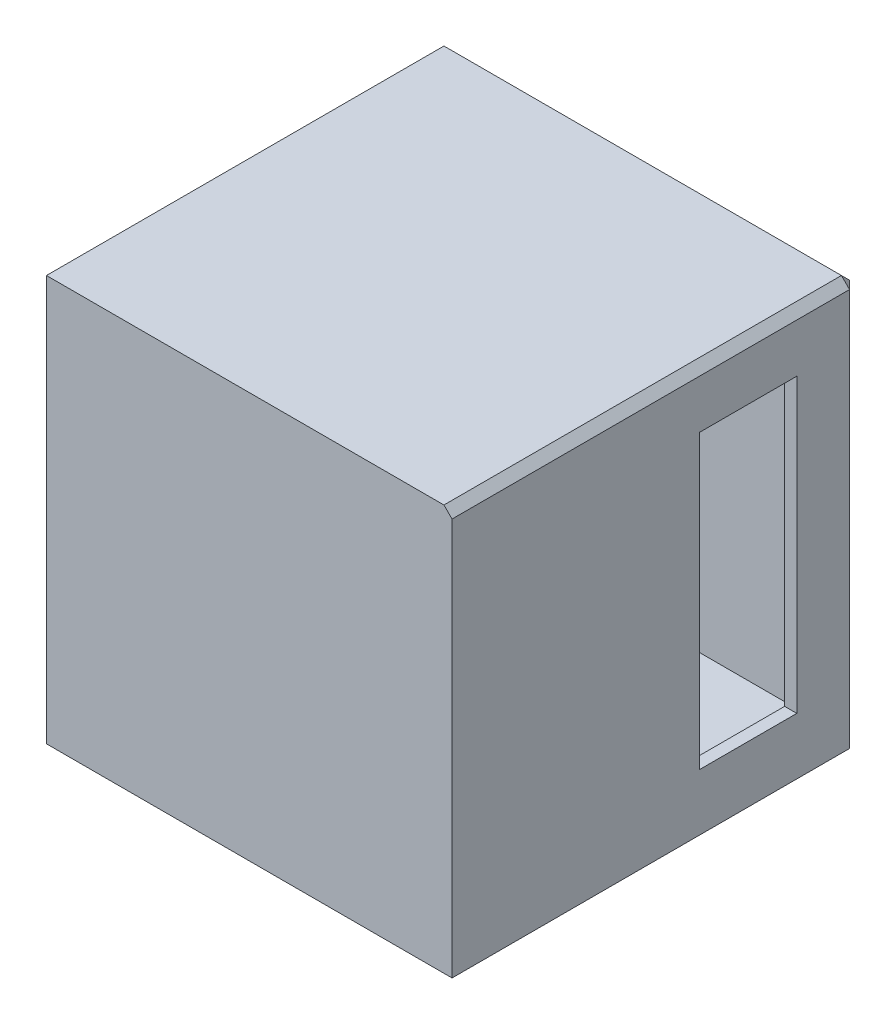
ISO-10303-21;
HEADER;
FILE_DESCRIPTION(('STEP AP214'),'2;1');
FILE_NAME('part.step','',(''),(''),'','','');
FILE_SCHEMA(('AUTOMOTIVE_DESIGN { 1 0 10303 214 1 1 1 1 }'));
ENDSEC;
DATA;
#1=APPLICATION_CONTEXT('core data for automotive mechanical design processes');
#2=APPLICATION_PROTOCOL_DEFINITION('international standard','automotive_design',2000,#1);
#3=PRODUCT_CONTEXT('',#1,'mechanical');
#4=PRODUCT('Part','Part','',(#3));
#5=PRODUCT_RELATED_PRODUCT_CATEGORY('part','',(#4));
#6=PRODUCT_DEFINITION_FORMATION('','',#4);
#7=PRODUCT_DEFINITION_CONTEXT('part definition',#1,'design');
#8=PRODUCT_DEFINITION('design','',#6,#7);
#9=PRODUCT_DEFINITION_SHAPE('','',#8);
#10=(LENGTH_UNIT() NAMED_UNIT(*) SI_UNIT(.MILLI.,.METRE.));
#11=(NAMED_UNIT(*) PLANE_ANGLE_UNIT() SI_UNIT($,.RADIAN.));
#12=(NAMED_UNIT(*) SI_UNIT($,.STERADIAN.) SOLID_ANGLE_UNIT());
#13=UNCERTAINTY_MEASURE_WITH_UNIT(LENGTH_MEASURE(1.E-05),#10,'distance_accuracy_value','');
#14=(GEOMETRIC_REPRESENTATION_CONTEXT(3) GLOBAL_UNCERTAINTY_ASSIGNED_CONTEXT((#13)) GLOBAL_UNIT_ASSIGNED_CONTEXT((#10,
#11,#12)) REPRESENTATION_CONTEXT('',''));
#15=CARTESIAN_POINT('',(0.,0.,0.));
#16=DIRECTION('',(0.,0.,1.));
#17=DIRECTION('',(1.,0.,0.));
#18=AXIS2_PLACEMENT_3D('',#15,#16,#17);
#19=CARTESIAN_POINT('',(0.,100.,3.));
#20=DIRECTION('',(1.,0.,0.));
#21=DIRECTION('',(0.,1.,0.));
#22=AXIS2_PLACEMENT_3D('',#19,#20,#21);
#23=PLANE('',#22);
#24=DIRECTION('',(0.,0.,-1.));
#25=VECTOR('',#24,1.);
#26=CARTESIAN_POINT('',(0.,100.,3.));
#27=LINE('',#26,#25);
#28=CARTESIAN_POINT('',(0.,100.,100.));
#29=VERTEX_POINT('',#28);
#30=CARTESIAN_POINT('',(0.,100.,2.));
#31=VERTEX_POINT('',#30);
#32=EDGE_CURVE('E230',#29,#31,#27,.T.);
#33=ORIENTED_EDGE('',*,*,#32,.T.);
#34=DIRECTION('',(0.,0.70710678118655,0.707106781186545));
#35=VECTOR('',#34,1.);
#36=CARTESIAN_POINT('',(0.,100.,2.));
#37=LINE('',#36,#35);
#38=CARTESIAN_POINT('',(0.,98.,0.));
#39=VERTEX_POINT('',#38);
#40=EDGE_CURVE('E11',#31,#39,#37,.F.);
#41=ORIENTED_EDGE('',*,*,#40,.T.);
#42=DIRECTION('',(0.,-1.,0.));
#43=VECTOR('',#42,1.);
#44=CARTESIAN_POINT('',(0.,100.,0.));
#45=LINE('',#44,#43);
#46=CARTESIAN_POINT('',(0.,0.,0.));
#47=VERTEX_POINT('',#46);
#48=EDGE_CURVE('E226',#39,#47,#45,.T.);
#49=ORIENTED_EDGE('',*,*,#48,.T.);
#50=DIRECTION('',(0.,0.,-1.));
#51=VECTOR('',#50,1.);
#52=CARTESIAN_POINT('',(0.,0.,3.));
#53=LINE('',#52,#51);
#54=CARTESIAN_POINT('',(0.,0.,100.));
#55=VERTEX_POINT('',#54);
#56=EDGE_CURVE('E236',#55,#47,#53,.T.);
#57=ORIENTED_EDGE('',*,*,#56,.F.);
#58=DIRECTION('',(0.,-1.,0.));
#59=VECTOR('',#58,1.);
#60=CARTESIAN_POINT('',(0.,100.,100.));
#61=LINE('',#60,#59);
#62=EDGE_CURVE('E180',#29,#55,#61,.T.);
#63=ORIENTED_EDGE('',*,*,#62,.F.);
#64=EDGE_LOOP('',(#33,#41,#49,#57,#63));
#65=FACE_BOUND('',#64,.T.);
#66=ADVANCED_FACE('F35',(#65),#23,.F.);
#67=CARTESIAN_POINT('',(0.,0.,3.));
#68=DIRECTION('',(0.,1.,0.));
#69=DIRECTION('',(0.,0.,1.));
#70=AXIS2_PLACEMENT_3D('',#67,#68,#69);
#71=PLANE('',#70);
#72=DIRECTION('',(1.,0.,0.));
#73=VECTOR('',#72,1.);
#74=CARTESIAN_POINT('',(0.,0.,0.));
#75=LINE('',#74,#73);
#76=CARTESIAN_POINT('',(97.9999999999999,0.,0.));
#77=VERTEX_POINT('',#76);
#78=EDGE_CURVE('E228',#47,#77,#75,.T.);
#79=ORIENTED_EDGE('',*,*,#78,.T.);
#80=DIRECTION('',(-0.70710678118655,0.,-0.707106781186545));
#81=VECTOR('',#80,1.);
#82=CARTESIAN_POINT('',(100.,0.,1.99999999999999));
#83=LINE('',#82,#81);
#84=CARTESIAN_POINT('',(100.,0.,2.00000000000001));
#85=VERTEX_POINT('',#84);
#86=EDGE_CURVE('E44',#77,#85,#83,.F.);
#87=ORIENTED_EDGE('',*,*,#86,.T.);
#88=DIRECTION('',(0.,0.,-1.));
#89=VECTOR('',#88,1.);
#90=CARTESIAN_POINT('',(100.,0.,3.));
#91=LINE('',#90,#89);
#92=CARTESIAN_POINT('',(100.,0.,100.));
#93=VERTEX_POINT('',#92);
#94=EDGE_CURVE('E233',#93,#85,#91,.T.);
#95=ORIENTED_EDGE('',*,*,#94,.F.);
#96=DIRECTION('',(1.,0.,0.));
#97=VECTOR('',#96,1.);
#98=CARTESIAN_POINT('',(0.,0.,100.));
#99=LINE('',#98,#97);
#100=EDGE_CURVE('E186',#55,#93,#99,.T.);
#101=ORIENTED_EDGE('',*,*,#100,.F.);
#102=ORIENTED_EDGE('',*,*,#56,.T.);
#103=EDGE_LOOP('',(#79,#87,#95,#101,#102));
#104=FACE_BOUND('',#103,.T.);
#105=ADVANCED_FACE('F283',(#104),#71,.F.);
#106=CARTESIAN_POINT('',(100.,100.,3.));
#107=DIRECTION('',(-1.,0.,0.));
#108=DIRECTION('',(0.,-1.,0.));
#109=AXIS2_PLACEMENT_3D('',#106,#107,#108);
#110=PLANE('',#109);
#111=DIRECTION('',(0.,0.,1.));
#112=VECTOR('',#111,1.);
#113=CARTESIAN_POINT('',(100.,86.,15.));
#114=LINE('',#113,#112);
#115=CARTESIAN_POINT('',(100.,86.,15.));
#116=VERTEX_POINT('',#115);
#117=CARTESIAN_POINT('',(100.,86.,39.));
#118=VERTEX_POINT('',#117);
#119=EDGE_CURVE('E174',#116,#118,#114,.T.);
#120=ORIENTED_EDGE('',*,*,#119,.F.);
#121=DIRECTION('',(0.,1.,0.));
#122=VECTOR('',#121,1.);
#123=CARTESIAN_POINT('',(100.,86.,15.));
#124=LINE('',#123,#122);
#125=CARTESIAN_POINT('',(100.,14.,15.));
#126=VERTEX_POINT('',#125);
#127=EDGE_CURVE('E147',#126,#116,#124,.T.);
#128=ORIENTED_EDGE('',*,*,#127,.F.);
#129=DIRECTION('',(0.,0.,-1.));
#130=VECTOR('',#129,1.);
#131=CARTESIAN_POINT('',(100.,14.,15.));
#132=LINE('',#131,#130);
#133=CARTESIAN_POINT('',(100.,14.,39.));
#134=VERTEX_POINT('',#133);
#135=EDGE_CURVE('E165',#134,#126,#132,.T.);
#136=ORIENTED_EDGE('',*,*,#135,.F.);
#137=DIRECTION('',(0.,-1.,0.));
#138=VECTOR('',#137,1.);
#139=CARTESIAN_POINT('',(100.,86.,39.));
#140=LINE('',#139,#138);
#141=EDGE_CURVE('E168',#118,#134,#140,.T.);
#142=ORIENTED_EDGE('',*,*,#141,.F.);
#143=EDGE_LOOP('',(#120,#128,#136,#142));
#144=FACE_BOUND('',#143,.T.);
#145=DIRECTION('',(0.,1.,0.));
#146=VECTOR('',#145,1.);
#147=CARTESIAN_POINT('',(100.,100.,2.));
#148=LINE('',#147,#146);
#149=CARTESIAN_POINT('',(100.,98.,2.));
#150=VERTEX_POINT('',#149);
#151=EDGE_CURVE('E244',#85,#150,#148,.T.);
#152=ORIENTED_EDGE('',*,*,#151,.T.);
#153=DIRECTION('',(0.,0.,1.));
#154=VECTOR('',#153,1.);
#155=CARTESIAN_POINT('',(100.,98.,3.));
#156=LINE('',#155,#154);
#157=CARTESIAN_POINT('',(100.,98.,100.));
#158=VERTEX_POINT('',#157);
#159=EDGE_CURVE('E246',#150,#158,#156,.T.);
#160=ORIENTED_EDGE('',*,*,#159,.T.);
#161=DIRECTION('',(0.,1.,0.));
#162=VECTOR('',#161,1.);
#163=CARTESIAN_POINT('',(100.,100.,100.));
#164=LINE('',#163,#162);
#165=EDGE_CURVE('E189',#93,#158,#164,.T.);
#166=ORIENTED_EDGE('',*,*,#165,.F.);
#167=ORIENTED_EDGE('',*,*,#94,.T.);
#168=EDGE_LOOP('',(#152,#160,#166,#167));
#169=FACE_BOUND('',#168,.T.);
#170=ADVANCED_FACE('F276',(#144,#169),#110,.F.);
#171=CARTESIAN_POINT('',(0.,100.,3.));
#172=DIRECTION('',(0.,-1.,0.));
#173=DIRECTION('',(0.,0.,-1.));
#174=AXIS2_PLACEMENT_3D('',#171,#172,#173);
#175=PLANE('',#174);
#176=DIRECTION('',(-1.,0.,0.));
#177=VECTOR('',#176,1.);
#178=CARTESIAN_POINT('',(0.,100.,100.));
#179=LINE('',#178,#177);
#180=CARTESIAN_POINT('',(97.9999999999999,100.,100.));
#181=VERTEX_POINT('',#180);
#182=EDGE_CURVE('E192',#181,#29,#179,.T.);
#183=ORIENTED_EDGE('',*,*,#182,.F.);
#184=DIRECTION('',(0.,0.,-1.));
#185=VECTOR('',#184,1.);
#186=CARTESIAN_POINT('',(98.,100.,3.));
#187=LINE('',#186,#185);
#188=CARTESIAN_POINT('',(98.,100.,2.));
#189=VERTEX_POINT('',#188);
#190=EDGE_CURVE('E241',#181,#189,#187,.T.);
#191=ORIENTED_EDGE('',*,*,#190,.T.);
#192=DIRECTION('',(-1.,0.,0.));
#193=VECTOR('',#192,1.);
#194=CARTESIAN_POINT('',(0.,100.,2.));
#195=LINE('',#194,#193);
#196=EDGE_CURVE('E239',#189,#31,#195,.T.);
#197=ORIENTED_EDGE('',*,*,#196,.T.);
#198=ORIENTED_EDGE('',*,*,#32,.F.);
#199=EDGE_LOOP('',(#183,#191,#197,#198));
#200=FACE_BOUND('',#199,.T.);
#201=ADVANCED_FACE('F269',(#200),#175,.F.);
#202=CARTESIAN_POINT('',(0.,0.,0.));
#203=DIRECTION('',(0.,0.,1.));
#204=DIRECTION('',(1.,0.,0.));
#205=AXIS2_PLACEMENT_3D('',#202,#203,#204);
#206=PLANE('',#205);
#207=DIRECTION('',(1.,0.,0.));
#208=VECTOR('',#207,1.);
#209=CARTESIAN_POINT('',(0.,98.,0.));
#210=LINE('',#209,#208);
#211=CARTESIAN_POINT('',(98.,98.,0.));
#212=VERTEX_POINT('',#211);
#213=EDGE_CURVE('E52',#39,#212,#210,.T.);
#214=ORIENTED_EDGE('',*,*,#213,.T.);
#215=DIRECTION('',(0.,-1.,0.));
#216=VECTOR('',#215,1.);
#217=CARTESIAN_POINT('',(98.,0.,0.));
#218=LINE('',#217,#216);
#219=EDGE_CURVE('E56',#212,#77,#218,.T.);
#220=ORIENTED_EDGE('',*,*,#219,.T.);
#221=ORIENTED_EDGE('',*,*,#78,.F.);
#222=ORIENTED_EDGE('',*,*,#48,.F.);
#223=EDGE_LOOP('',(#214,#220,#221,#222));
#224=FACE_BOUND('',#223,.T.);
#225=ADVANCED_FACE('F331',(#224),#206,.F.);
#226=CARTESIAN_POINT('',(0.,0.,100.));
#227=DIRECTION('',(0.,0.,1.));
#228=DIRECTION('',(1.,0.,0.));
#229=AXIS2_PLACEMENT_3D('',#226,#227,#228);
#230=PLANE('',#229);
#231=ORIENTED_EDGE('',*,*,#165,.T.);
#232=DIRECTION('',(0.707106781186545,-0.70710678118655,0.));
#233=VECTOR('',#232,1.);
#234=CARTESIAN_POINT('',(99.0000000000003,98.9999999999996,100.));
#235=LINE('',#234,#233);
#236=EDGE_CURVE('E248',#158,#181,#235,.F.);
#237=ORIENTED_EDGE('',*,*,#236,.T.);
#238=ORIENTED_EDGE('',*,*,#182,.T.);
#239=ORIENTED_EDGE('',*,*,#62,.T.);
#240=ORIENTED_EDGE('',*,*,#100,.T.);
#241=EDGE_LOOP('',(#231,#237,#238,#239,#240));
#242=FACE_BOUND('',#241,.T.);
#243=ADVANCED_FACE('F279',(#242),#230,.T.);
#244=CARTESIAN_POINT('',(97.,86.,15.));
#245=DIRECTION('',(0.,0.,-1.));
#246=DIRECTION('',(0.,1.,0.));
#247=AXIS2_PLACEMENT_3D('',#244,#245,#246);
#248=PLANE('',#247);
#249=ORIENTED_EDGE('',*,*,#127,.T.);
#250=DIRECTION('',(1.,0.,0.));
#251=VECTOR('',#250,1.);
#252=CARTESIAN_POINT('',(97.,86.,15.));
#253=LINE('',#252,#251);
#254=CARTESIAN_POINT('',(97.,86.,15.));
#255=VERTEX_POINT('',#254);
#256=EDGE_CURVE('E140',#255,#116,#253,.T.);
#257=ORIENTED_EDGE('',*,*,#256,.F.);
#258=DIRECTION('',(0.,1.,0.));
#259=VECTOR('',#258,1.);
#260=CARTESIAN_POINT('',(97.,86.,15.));
#261=LINE('',#260,#259);
#262=CARTESIAN_POINT('',(97.,14.,15.));
#263=VERTEX_POINT('',#262);
#264=EDGE_CURVE('E144',#263,#255,#261,.T.);
#265=ORIENTED_EDGE('',*,*,#264,.F.);
#266=DIRECTION('',(1.,0.,0.));
#267=VECTOR('',#266,1.);
#268=CARTESIAN_POINT('',(97.,14.,15.));
#269=LINE('',#268,#267);
#270=EDGE_CURVE('E178',#263,#126,#269,.T.);
#271=ORIENTED_EDGE('',*,*,#270,.T.);
#272=EDGE_LOOP('',(#249,#257,#265,#271));
#273=FACE_BOUND('',#272,.T.);
#274=ADVANCED_FACE('F142',(#273),#248,.F.);
#275=CARTESIAN_POINT('',(97.,14.,15.));
#276=DIRECTION('',(0.,-1.,0.));
#277=DIRECTION('',(1.,0.,0.));
#278=AXIS2_PLACEMENT_3D('',#275,#276,#277);
#279=PLANE('',#278);
#280=ORIENTED_EDGE('',*,*,#135,.T.);
#281=ORIENTED_EDGE('',*,*,#270,.F.);
#282=DIRECTION('',(0.,0.,-1.));
#283=VECTOR('',#282,1.);
#284=CARTESIAN_POINT('',(97.,14.,15.));
#285=LINE('',#284,#283);
#286=CARTESIAN_POINT('',(97.,14.,39.));
#287=VERTEX_POINT('',#286);
#288=EDGE_CURVE('E152',#287,#263,#285,.T.);
#289=ORIENTED_EDGE('',*,*,#288,.F.);
#290=DIRECTION('',(1.,0.,0.));
#291=VECTOR('',#290,1.);
#292=CARTESIAN_POINT('',(97.,14.,39.));
#293=LINE('',#292,#291);
#294=EDGE_CURVE('E181',#287,#134,#293,.T.);
#295=ORIENTED_EDGE('',*,*,#294,.T.);
#296=EDGE_LOOP('',(#280,#281,#289,#295));
#297=FACE_BOUND('',#296,.T.);
#298=ADVANCED_FACE('F405',(#297),#279,.F.);
#299=CARTESIAN_POINT('',(97.,86.,39.));
#300=DIRECTION('',(0.,0.,1.));
#301=DIRECTION('',(0.,-1.,0.));
#302=AXIS2_PLACEMENT_3D('',#299,#300,#301);
#303=PLANE('',#302);
#304=ORIENTED_EDGE('',*,*,#141,.T.);
#305=ORIENTED_EDGE('',*,*,#294,.F.);
#306=DIRECTION('',(0.,-1.,0.));
#307=VECTOR('',#306,1.);
#308=CARTESIAN_POINT('',(97.,86.,39.));
#309=LINE('',#308,#307);
#310=CARTESIAN_POINT('',(97.,86.,39.));
#311=VERTEX_POINT('',#310);
#312=EDGE_CURVE('E160',#311,#287,#309,.T.);
#313=ORIENTED_EDGE('',*,*,#312,.F.);
#314=DIRECTION('',(1.,0.,0.));
#315=VECTOR('',#314,1.);
#316=CARTESIAN_POINT('',(97.,86.,39.));
#317=LINE('',#316,#315);
#318=EDGE_CURVE('E151',#311,#118,#317,.T.);
#319=ORIENTED_EDGE('',*,*,#318,.T.);
#320=EDGE_LOOP('',(#304,#305,#313,#319));
#321=FACE_BOUND('',#320,.T.);
#322=ADVANCED_FACE('F395',(#321),#303,.F.);
#323=CARTESIAN_POINT('',(97.,86.,15.));
#324=DIRECTION('',(0.,1.,0.));
#325=DIRECTION('',(0.,0.,1.));
#326=AXIS2_PLACEMENT_3D('',#323,#324,#325);
#327=PLANE('',#326);
#328=ORIENTED_EDGE('',*,*,#119,.T.);
#329=ORIENTED_EDGE('',*,*,#318,.F.);
#330=DIRECTION('',(0.,0.,1.));
#331=VECTOR('',#330,1.);
#332=CARTESIAN_POINT('',(97.,86.,15.));
#333=LINE('',#332,#331);
#334=EDGE_CURVE('E156',#255,#311,#333,.T.);
#335=ORIENTED_EDGE('',*,*,#334,.F.);
#336=ORIENTED_EDGE('',*,*,#256,.T.);
#337=EDGE_LOOP('',(#328,#329,#335,#336));
#338=FACE_BOUND('',#337,.T.);
#339=ADVANCED_FACE('F157',(#338),#327,.F.);
#340=CARTESIAN_POINT('',(0.,0.,3.));
#341=DIRECTION('',(0.,0.,1.));
#342=DIRECTION('',(1.,0.,0.));
#343=AXIS2_PLACEMENT_3D('',#340,#341,#342);
#344=PLANE('',#343);
#345=DIRECTION('',(0.,-1.,0.));
#346=VECTOR('',#345,1.);
#347=CARTESIAN_POINT('',(3.,97.,3.));
#348=LINE('',#347,#346);
#349=CARTESIAN_POINT('',(3.,97.,3.));
#350=VERTEX_POINT('',#349);
#351=CARTESIAN_POINT('',(3.00000000000001,3.,3.));
#352=VERTEX_POINT('',#351);
#353=EDGE_CURVE('E194',#350,#352,#348,.T.);
#354=ORIENTED_EDGE('',*,*,#353,.T.);
#355=DIRECTION('',(1.,0.,0.));
#356=VECTOR('',#355,1.);
#357=CARTESIAN_POINT('',(3.00000000000001,3.,3.));
#358=LINE('',#357,#356);
#359=CARTESIAN_POINT('',(97.,3.,3.));
#360=VERTEX_POINT('',#359);
#361=EDGE_CURVE('E210',#352,#360,#358,.T.);
#362=ORIENTED_EDGE('',*,*,#361,.T.);
#363=DIRECTION('',(0.,1.,0.));
#364=VECTOR('',#363,1.);
#365=CARTESIAN_POINT('',(97.,97.,3.));
#366=LINE('',#365,#364);
#367=CARTESIAN_POINT('',(97.,97.,3.));
#368=VERTEX_POINT('',#367);
#369=EDGE_CURVE('E212',#360,#368,#366,.T.);
#370=ORIENTED_EDGE('',*,*,#369,.T.);
#371=DIRECTION('',(-1.,0.,0.));
#372=VECTOR('',#371,1.);
#373=CARTESIAN_POINT('',(3.,97.,3.));
#374=LINE('',#373,#372);
#375=EDGE_CURVE('E199',#368,#350,#374,.T.);
#376=ORIENTED_EDGE('',*,*,#375,.T.);
#377=EDGE_LOOP('',(#354,#362,#370,#376));
#378=FACE_BOUND('',#377,.T.);
#379=ADVANCED_FACE('F394',(#378),#344,.T.);
#380=CARTESIAN_POINT('',(3.,97.,97.));
#381=DIRECTION('',(0.,-1.,0.));
#382=DIRECTION('',(0.,0.,-1.));
#383=AXIS2_PLACEMENT_3D('',#380,#381,#382);
#384=PLANE('',#383);
#385=ORIENTED_EDGE('',*,*,#375,.F.);
#386=DIRECTION('',(0.,0.,-1.));
#387=VECTOR('',#386,1.);
#388=CARTESIAN_POINT('',(97.,97.,97.));
#389=LINE('',#388,#387);
#390=CARTESIAN_POINT('',(97.,97.,97.));
#391=VERTEX_POINT('',#390);
#392=EDGE_CURVE('E217',#391,#368,#389,.T.);
#393=ORIENTED_EDGE('',*,*,#392,.F.);
#394=DIRECTION('',(-1.,0.,0.));
#395=VECTOR('',#394,1.);
#396=CARTESIAN_POINT('',(3.,97.,97.));
#397=LINE('',#396,#395);
#398=CARTESIAN_POINT('',(3.,97.,97.));
#399=VERTEX_POINT('',#398);
#400=EDGE_CURVE('E205',#391,#399,#397,.T.);
#401=ORIENTED_EDGE('',*,*,#400,.T.);
#402=DIRECTION('',(0.,0.,-1.));
#403=VECTOR('',#402,1.);
#404=CARTESIAN_POINT('',(3.,97.,97.));
#405=LINE('',#404,#403);
#406=EDGE_CURVE('E208',#399,#350,#405,.T.);
#407=ORIENTED_EDGE('',*,*,#406,.T.);
#408=EDGE_LOOP('',(#385,#393,#401,#407));
#409=FACE_BOUND('',#408,.T.);
#410=ADVANCED_FACE('F383',(#409),#384,.T.);
#411=CARTESIAN_POINT('',(97.,97.,97.));
#412=DIRECTION('',(-1.,0.,0.));
#413=DIRECTION('',(0.,-1.,0.));
#414=AXIS2_PLACEMENT_3D('',#411,#412,#413);
#415=PLANE('',#414);
#416=ORIENTED_EDGE('',*,*,#264,.T.);
#417=ORIENTED_EDGE('',*,*,#334,.T.);
#418=ORIENTED_EDGE('',*,*,#312,.T.);
#419=ORIENTED_EDGE('',*,*,#288,.T.);
#420=EDGE_LOOP('',(#416,#417,#418,#419));
#421=FACE_BOUND('',#420,.T.);
#422=ORIENTED_EDGE('',*,*,#369,.F.);
#423=DIRECTION('',(0.,0.,-1.));
#424=VECTOR('',#423,1.);
#425=CARTESIAN_POINT('',(97.,3.,97.));
#426=LINE('',#425,#424);
#427=CARTESIAN_POINT('',(97.,3.,97.));
#428=VERTEX_POINT('',#427);
#429=EDGE_CURVE('E220',#428,#360,#426,.T.);
#430=ORIENTED_EDGE('',*,*,#429,.F.);
#431=DIRECTION('',(0.,1.,0.));
#432=VECTOR('',#431,1.);
#433=CARTESIAN_POINT('',(97.,97.,97.));
#434=LINE('',#433,#432);
#435=EDGE_CURVE('E202',#428,#391,#434,.T.);
#436=ORIENTED_EDGE('',*,*,#435,.T.);
#437=ORIENTED_EDGE('',*,*,#392,.T.);
#438=EDGE_LOOP('',(#422,#430,#436,#437));
#439=FACE_BOUND('',#438,.T.);
#440=ADVANCED_FACE('F162',(#421,#439),#415,.T.);
#441=CARTESIAN_POINT('',(3.00000000000001,3.,97.));
#442=DIRECTION('',(0.,1.,0.));
#443=DIRECTION('',(0.,0.,1.));
#444=AXIS2_PLACEMENT_3D('',#441,#442,#443);
#445=PLANE('',#444);
#446=ORIENTED_EDGE('',*,*,#361,.F.);
#447=DIRECTION('',(0.,0.,-1.));
#448=VECTOR('',#447,1.);
#449=CARTESIAN_POINT('',(3.00000000000001,3.,97.));
#450=LINE('',#449,#448);
#451=CARTESIAN_POINT('',(3.00000000000001,3.,97.));
#452=VERTEX_POINT('',#451);
#453=EDGE_CURVE('E223',#452,#352,#450,.T.);
#454=ORIENTED_EDGE('',*,*,#453,.F.);
#455=DIRECTION('',(1.,0.,0.));
#456=VECTOR('',#455,1.);
#457=CARTESIAN_POINT('',(3.00000000000001,3.,97.));
#458=LINE('',#457,#456);
#459=EDGE_CURVE('E198',#452,#428,#458,.T.);
#460=ORIENTED_EDGE('',*,*,#459,.T.);
#461=ORIENTED_EDGE('',*,*,#429,.T.);
#462=EDGE_LOOP('',(#446,#454,#460,#461));
#463=FACE_BOUND('',#462,.T.);
#464=ADVANCED_FACE('F382',(#463),#445,.T.);
#465=CARTESIAN_POINT('',(3.,97.,97.));
#466=DIRECTION('',(1.,0.,0.));
#467=DIRECTION('',(0.,1.,0.));
#468=AXIS2_PLACEMENT_3D('',#465,#466,#467);
#469=PLANE('',#468);
#470=ORIENTED_EDGE('',*,*,#353,.F.);
#471=ORIENTED_EDGE('',*,*,#406,.F.);
#472=DIRECTION('',(0.,-1.,0.));
#473=VECTOR('',#472,1.);
#474=CARTESIAN_POINT('',(3.,97.,97.));
#475=LINE('',#474,#473);
#476=EDGE_CURVE('E195',#399,#452,#475,.T.);
#477=ORIENTED_EDGE('',*,*,#476,.T.);
#478=ORIENTED_EDGE('',*,*,#453,.T.);
#479=EDGE_LOOP('',(#470,#471,#477,#478));
#480=FACE_BOUND('',#479,.T.);
#481=ADVANCED_FACE('F429',(#480),#469,.T.);
#482=CARTESIAN_POINT('',(0.,0.,97.));
#483=DIRECTION('',(0.,0.,1.));
#484=DIRECTION('',(1.,0.,0.));
#485=AXIS2_PLACEMENT_3D('',#482,#483,#484);
#486=PLANE('',#485);
#487=ORIENTED_EDGE('',*,*,#476,.F.);
#488=ORIENTED_EDGE('',*,*,#400,.F.);
#489=ORIENTED_EDGE('',*,*,#435,.F.);
#490=ORIENTED_EDGE('',*,*,#459,.F.);
#491=EDGE_LOOP('',(#487,#488,#489,#490));
#492=FACE_BOUND('',#491,.T.);
#493=ADVANCED_FACE('F293',(#492),#486,.F.);
#494=CARTESIAN_POINT('',(0.,100.,2.));
#495=DIRECTION('',(0.,-0.707106781186545,0.70710678118655));
#496=DIRECTION('',(-1.,0.,0.));
#497=AXIS2_PLACEMENT_3D('',#494,#495,#496);
#498=PLANE('',#497);
#499=ORIENTED_EDGE('',*,*,#40,.F.);
#500=ORIENTED_EDGE('',*,*,#196,.F.);
#501=DIRECTION('',(0.,-0.70710678118655,-0.707106781186545));
#502=VECTOR('',#501,1.);
#503=CARTESIAN_POINT('',(98.,100.,2.));
#504=LINE('',#503,#502);
#505=EDGE_CURVE('E39',#212,#189,#504,.F.);
#506=ORIENTED_EDGE('',*,*,#505,.F.);
#507=ORIENTED_EDGE('',*,*,#213,.F.);
#508=EDGE_LOOP('',(#499,#500,#506,#507));
#509=FACE_BOUND('',#508,.T.);
#510=ADVANCED_FACE('F37',(#509),#498,.F.);
#511=CARTESIAN_POINT('',(100.,100.,2.));
#512=DIRECTION('',(-0.707106781186545,0.,0.70710678118655));
#513=DIRECTION('',(0.,1.,0.));
#514=AXIS2_PLACEMENT_3D('',#511,#512,#513);
#515=PLANE('',#514);
#516=ORIENTED_EDGE('',*,*,#86,.F.);
#517=ORIENTED_EDGE('',*,*,#219,.F.);
#518=DIRECTION('',(0.70710678118655,0.,0.707106781186545));
#519=VECTOR('',#518,1.);
#520=CARTESIAN_POINT('',(99.,98.,1.));
#521=LINE('',#520,#519);
#522=EDGE_CURVE('E254',#150,#212,#521,.F.);
#523=ORIENTED_EDGE('',*,*,#522,.F.);
#524=ORIENTED_EDGE('',*,*,#151,.F.);
#525=EDGE_LOOP('',(#516,#517,#523,#524));
#526=FACE_BOUND('',#525,.T.);
#527=ADVANCED_FACE('F286',(#526),#515,.F.);
#528=CARTESIAN_POINT('',(98.,100.,2.));
#529=DIRECTION('',(0.577350269189626,0.577350269189622,-0.57735026918963));
#530=DIRECTION('',(-0.70710678118655,0.,-0.707106781186545));
#531=AXIS2_PLACEMENT_3D('',#528,#529,#530);
#532=PLANE('',#531);
#533=ORIENTED_EDGE('',*,*,#522,.T.);
#534=ORIENTED_EDGE('',*,*,#505,.T.);
#535=DIRECTION('',(-0.707106781186545,0.70710678118655,0.));
#536=VECTOR('',#535,1.);
#537=CARTESIAN_POINT('',(98.,100.,2.));
#538=LINE('',#537,#536);
#539=EDGE_CURVE('E253',#150,#189,#538,.T.);
#540=ORIENTED_EDGE('',*,*,#539,.F.);
#541=EDGE_LOOP('',(#533,#534,#540));
#542=FACE_BOUND('',#541,.T.);
#543=ADVANCED_FACE('F262',(#542),#532,.T.);
#544=CARTESIAN_POINT('',(98.,100.,3.));
#545=DIRECTION('',(-0.70710678118655,-0.707106781186545,0.));
#546=DIRECTION('',(0.,0.,-1.));
#547=AXIS2_PLACEMENT_3D('',#544,#545,#546);
#548=PLANE('',#547);
#549=ORIENTED_EDGE('',*,*,#236,.F.);
#550=ORIENTED_EDGE('',*,*,#159,.F.);
#551=ORIENTED_EDGE('',*,*,#539,.T.);
#552=ORIENTED_EDGE('',*,*,#190,.F.);
#553=EDGE_LOOP('',(#549,#550,#551,#552));
#554=FACE_BOUND('',#553,.T.);
#555=ADVANCED_FACE('F272',(#554),#548,.F.);
#556=CLOSED_SHELL('',(#66,#105,#170,#201,#225,#243,#274,#298,#322,#339,#379,#410,#440,#464,#481,
#493,#510,#527,#543,#555));
#557=MANIFOLD_SOLID_BREP('B2',#556);
#558=ADVANCED_BREP_SHAPE_REPRESENTATION('',(#18,#557),#14);
#559=SHAPE_DEFINITION_REPRESENTATION(#9,#558);
ENDSEC;
END-ISO-10303-21;
